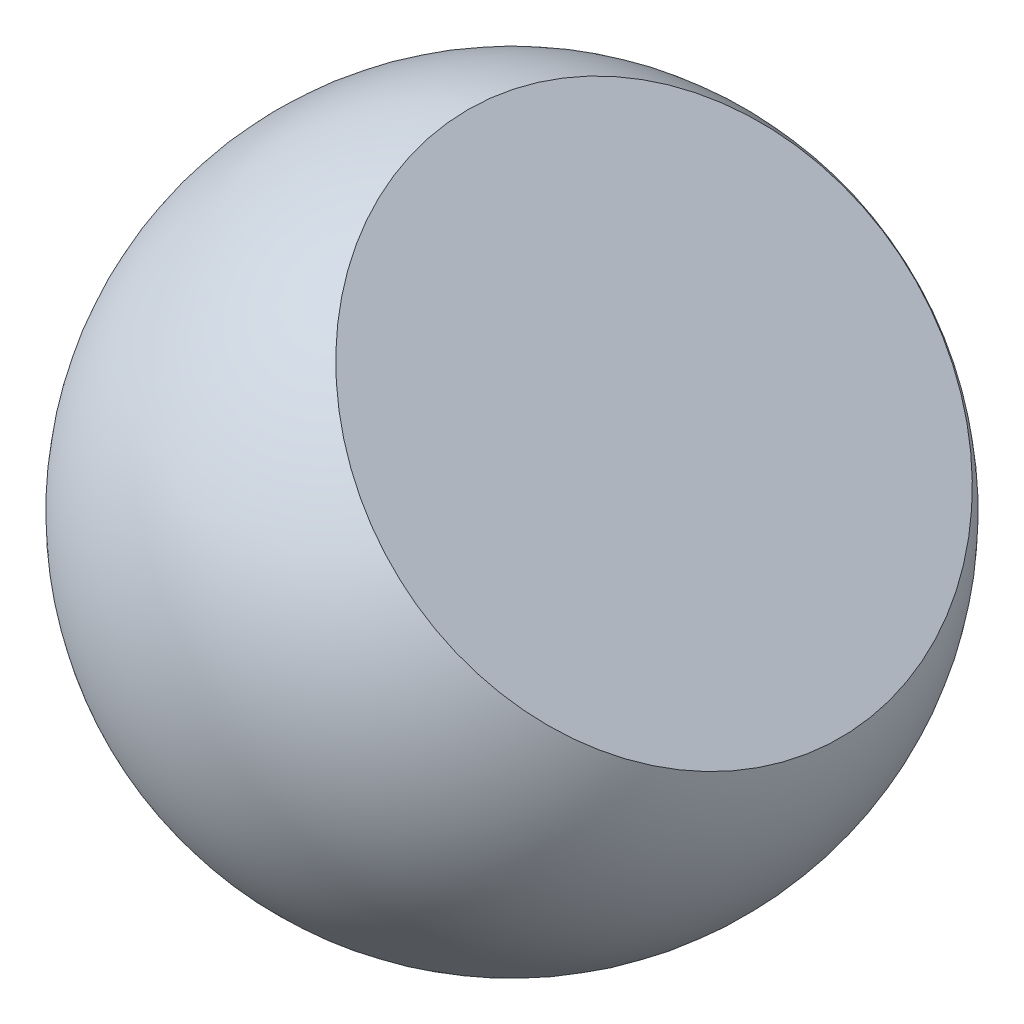
ISO-10303-21;
HEADER;
FILE_DESCRIPTION(('STEP AP214'),'2;1');
FILE_NAME('part.step','',(''),(''),'','','');
FILE_SCHEMA(('AUTOMOTIVE_DESIGN { 1 0 10303 214 1 1 1 1 }'));
ENDSEC;
DATA;
#1=APPLICATION_CONTEXT('core data for automotive mechanical design processes');
#2=APPLICATION_PROTOCOL_DEFINITION('international standard','automotive_design',2000,#1);
#3=PRODUCT_CONTEXT('',#1,'mechanical');
#4=PRODUCT('Part','Part','',(#3));
#5=PRODUCT_RELATED_PRODUCT_CATEGORY('part','',(#4));
#6=PRODUCT_DEFINITION_FORMATION('','',#4);
#7=PRODUCT_DEFINITION_CONTEXT('part definition',#1,'design');
#8=PRODUCT_DEFINITION('design','',#6,#7);
#9=PRODUCT_DEFINITION_SHAPE('','',#8);
#10=(LENGTH_UNIT() NAMED_UNIT(*) SI_UNIT(.MILLI.,.METRE.));
#11=(NAMED_UNIT(*) PLANE_ANGLE_UNIT() SI_UNIT($,.RADIAN.));
#12=(NAMED_UNIT(*) SI_UNIT($,.STERADIAN.) SOLID_ANGLE_UNIT());
#13=UNCERTAINTY_MEASURE_WITH_UNIT(LENGTH_MEASURE(1.E-05),#10,'distance_accuracy_value','');
#14=(GEOMETRIC_REPRESENTATION_CONTEXT(3) GLOBAL_UNCERTAINTY_ASSIGNED_CONTEXT((#13)) GLOBAL_UNIT_ASSIGNED_CONTEXT((#10,
#11,#12)) REPRESENTATION_CONTEXT('',''));
#15=CARTESIAN_POINT('',(0.,0.,0.));
#16=DIRECTION('',(0.,0.,1.));
#17=DIRECTION('',(1.,0.,0.));
#18=AXIS2_PLACEMENT_3D('',#15,#16,#17);
#19=CARTESIAN_POINT('',(0.,0.,0.));
#20=DIRECTION('',(-1.,0.,0.));
#21=DIRECTION('',(0.,0.,-1.));
#22=AXIS2_PLACEMENT_3D('',#19,#20,#21);
#23=SPHERICAL_SURFACE('',#22,381.);
#24=CARTESIAN_POINT('',(0.,0.,0.));
#25=DIRECTION('',(0.69354709763802,0.720411287639136,0.));
#26=DIRECTION('',(-0.720411287639136,0.69354709763802,0.));
#27=AXIS2_PLACEMENT_3D('',#24,#25,#26);
#28=SPHERICAL_SURFACE('',#27,381.);
#29=CARTESIAN_POINT('',(164.227634794267,170.588907733873,0.));
#30=DIRECTION('',(0.69354709763802,0.720411287639136,0.));
#31=DIRECTION('',(-0.720411287639136,0.69354709763802,0.));
#32=AXIS2_PLACEMENT_3D('',#29,#30,#31);
#33=CIRCLE('',#32,298.478991770015);
#34=CARTESIAN_POINT('',(-50.8000000000002,377.59814618189,0.));
#35=VERTEX_POINT('',#34);
#36=EDGE_CURVE('E11',#35,#35,#33,.T.);
#37=ORIENTED_EDGE('',*,*,#36,.F.);
#38=EDGE_LOOP('',(#37));
#39=FACE_BOUND('',#38,.T.);
#40=ADVANCED_FACE('F30',(#39),#28,.T.);
#41=CARTESIAN_POINT('',(164.227634794267,170.588907733873,0.));
#42=DIRECTION('',(0.69354709763802,0.720411287639136,0.));
#43=DIRECTION('',(-0.720411287639136,0.69354709763802,0.));
#44=AXIS2_PLACEMENT_3D('',#41,#42,#43);
#45=PLANE('',#44);
#46=ORIENTED_EDGE('',*,*,#36,.T.);
#47=EDGE_LOOP('',(#46));
#48=FACE_BOUND('',#47,.T.);
#49=ADVANCED_FACE('F37',(#48),#45,.T.);
#50=CLOSED_SHELL('',(#40,#49));
#51=MANIFOLD_SOLID_BREP('B2',#50);
#52=ADVANCED_BREP_SHAPE_REPRESENTATION('',(#18,#51),#14);
#53=SHAPE_DEFINITION_REPRESENTATION(#9,#52);
ENDSEC;
END-ISO-10303-21;
